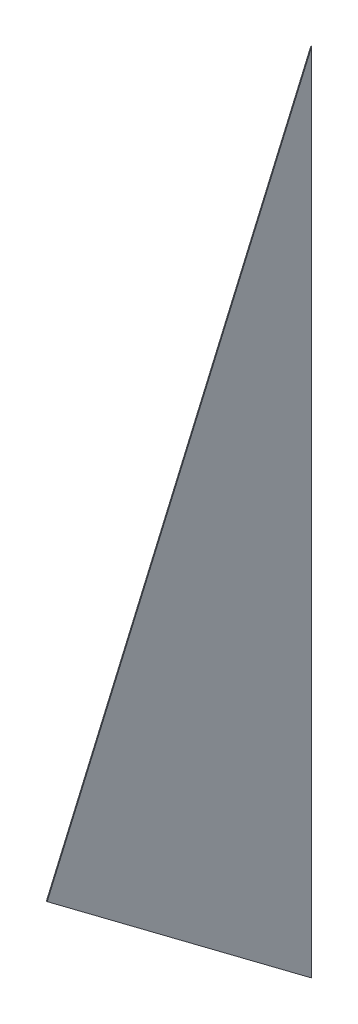
ISO-10303-21;
HEADER;
FILE_DESCRIPTION(('STEP AP214'),'2;1');
FILE_NAME('part.step','',(''),(''),'','','');
FILE_SCHEMA(('AUTOMOTIVE_DESIGN { 1 0 10303 214 1 1 1 1 }'));
ENDSEC;
DATA;
#1=APPLICATION_CONTEXT('core data for automotive mechanical design processes');
#2=APPLICATION_PROTOCOL_DEFINITION('international standard','automotive_design',2000,#1);
#3=PRODUCT_CONTEXT('',#1,'mechanical');
#4=PRODUCT('Part','Part','',(#3));
#5=PRODUCT_RELATED_PRODUCT_CATEGORY('part','',(#4));
#6=PRODUCT_DEFINITION_FORMATION('','',#4);
#7=PRODUCT_DEFINITION_CONTEXT('part definition',#1,'design');
#8=PRODUCT_DEFINITION('design','',#6,#7);
#9=PRODUCT_DEFINITION_SHAPE('','',#8);
#10=(LENGTH_UNIT() NAMED_UNIT(*) SI_UNIT(.MILLI.,.METRE.));
#11=(NAMED_UNIT(*) PLANE_ANGLE_UNIT() SI_UNIT($,.RADIAN.));
#12=(NAMED_UNIT(*) SI_UNIT($,.STERADIAN.) SOLID_ANGLE_UNIT());
#13=UNCERTAINTY_MEASURE_WITH_UNIT(LENGTH_MEASURE(1.E-05),#10,'distance_accuracy_value','');
#14=(GEOMETRIC_REPRESENTATION_CONTEXT(3) GLOBAL_UNCERTAINTY_ASSIGNED_CONTEXT((#13)) GLOBAL_UNIT_ASSIGNED_CONTEXT((#10,
#11,#12)) REPRESENTATION_CONTEXT('',''));
#15=CARTESIAN_POINT('',(0.,0.,0.));
#16=DIRECTION('',(0.,0.,1.));
#17=DIRECTION('',(1.,0.,0.));
#18=AXIS2_PLACEMENT_3D('',#15,#16,#17);
#19=CARTESIAN_POINT('',(1.5875,-762.,-1016.));
#20=DIRECTION('',(0.,0.8,-0.6));
#21=DIRECTION('',(0.,0.6,0.8));
#22=AXIS2_PLACEMENT_3D('',#19,#20,#21);
#23=PLANE('',#22);
#24=DIRECTION('',(0.,-0.6,-0.8));
#25=VECTOR('',#24,1.);
#26=CARTESIAN_POINT('',(-1.5875,-762.,-1016.));
#27=LINE('',#26,#25);
#28=CARTESIAN_POINT('',(-1.5875,0.,0.));
#29=VERTEX_POINT('',#28);
#30=CARTESIAN_POINT('',(-1.5875,-762.,-1016.));
#31=VERTEX_POINT('',#30);
#32=EDGE_CURVE('E79',#29,#31,#27,.T.);
#33=ORIENTED_EDGE('',*,*,#32,.T.);
#34=DIRECTION('',(-1.,0.,0.));
#35=VECTOR('',#34,1.);
#36=CARTESIAN_POINT('',(1.5875,-762.,-1016.));
#37=LINE('',#36,#35);
#38=CARTESIAN_POINT('',(1.5875,-762.,-1016.));
#39=VERTEX_POINT('',#38);
#40=EDGE_CURVE('E11',#39,#31,#37,.T.);
#41=ORIENTED_EDGE('',*,*,#40,.F.);
#42=DIRECTION('',(0.,-0.6,-0.8));
#43=VECTOR('',#42,1.);
#44=CARTESIAN_POINT('',(1.5875,-762.,-1016.));
#45=LINE('',#44,#43);
#46=CARTESIAN_POINT('',(1.5875,0.,0.));
#47=VERTEX_POINT('',#46);
#48=EDGE_CURVE('E72',#47,#39,#45,.T.);
#49=ORIENTED_EDGE('',*,*,#48,.F.);
#50=DIRECTION('',(-1.,0.,0.));
#51=VECTOR('',#50,1.);
#52=CARTESIAN_POINT('',(1.5875,0.,0.));
#53=LINE('',#52,#51);
#54=EDGE_CURVE('E80',#47,#29,#53,.T.);
#55=ORIENTED_EDGE('',*,*,#54,.T.);
#56=EDGE_LOOP('',(#33,#41,#49,#55));
#57=FACE_BOUND('',#56,.T.);
#58=ADVANCED_FACE('F32',(#57),#23,.F.);
#59=CARTESIAN_POINT('',(1.5875,2336.8,-1016.));
#60=DIRECTION('',(0.,0.,1.));
#61=DIRECTION('',(0.,-1.,0.));
#62=AXIS2_PLACEMENT_3D('',#59,#60,#61);
#63=PLANE('',#62);
#64=DIRECTION('',(0.,1.,0.));
#65=VECTOR('',#64,1.);
#66=CARTESIAN_POINT('',(-1.5875,2336.8,-1016.));
#67=LINE('',#66,#65);
#68=CARTESIAN_POINT('',(-1.5875,2336.8,-1016.));
#69=VERTEX_POINT('',#68);
#70=EDGE_CURVE('E60',#31,#69,#67,.T.);
#71=ORIENTED_EDGE('',*,*,#70,.T.);
#72=DIRECTION('',(-1.,0.,0.));
#73=VECTOR('',#72,1.);
#74=CARTESIAN_POINT('',(1.5875,2336.8,-1016.));
#75=LINE('',#74,#73);
#76=CARTESIAN_POINT('',(1.5875,2336.8,-1016.));
#77=VERTEX_POINT('',#76);
#78=EDGE_CURVE('E40',#77,#69,#75,.T.);
#79=ORIENTED_EDGE('',*,*,#78,.F.);
#80=DIRECTION('',(0.,1.,0.));
#81=VECTOR('',#80,1.);
#82=CARTESIAN_POINT('',(1.5875,2336.8,-1016.));
#83=LINE('',#82,#81);
#84=EDGE_CURVE('E68',#39,#77,#83,.T.);
#85=ORIENTED_EDGE('',*,*,#84,.F.);
#86=ORIENTED_EDGE('',*,*,#40,.T.);
#87=EDGE_LOOP('',(#71,#79,#85,#86));
#88=FACE_BOUND('',#87,.T.);
#89=ADVANCED_FACE('F69',(#88),#63,.F.);
#90=CARTESIAN_POINT('',(1.5875,0.,0.));
#91=DIRECTION('',(0.,-0.39872611141445,-0.917070056253235));
#92=DIRECTION('',(0.,0.917070056253235,-0.39872611141445));
#93=AXIS2_PLACEMENT_3D('',#90,#91,#92);
#94=PLANE('',#93);
#95=DIRECTION('',(0.,-0.917070056253235,0.39872611141445));
#96=VECTOR('',#95,1.);
#97=CARTESIAN_POINT('',(-1.5875,0.,0.));
#98=LINE('',#97,#96);
#99=EDGE_CURVE('E65',#69,#29,#98,.T.);
#100=ORIENTED_EDGE('',*,*,#99,.T.);
#101=ORIENTED_EDGE('',*,*,#54,.F.);
#102=DIRECTION('',(0.,-0.917070056253235,0.39872611141445));
#103=VECTOR('',#102,1.);
#104=CARTESIAN_POINT('',(1.5875,0.,0.));
#105=LINE('',#104,#103);
#106=EDGE_CURVE('E48',#77,#47,#105,.T.);
#107=ORIENTED_EDGE('',*,*,#106,.F.);
#108=ORIENTED_EDGE('',*,*,#78,.T.);
#109=EDGE_LOOP('',(#100,#101,#107,#108));
#110=FACE_BOUND('',#109,.T.);
#111=ADVANCED_FACE('F87',(#110),#94,.F.);
#112=CARTESIAN_POINT('',(1.5875,0.,0.));
#113=DIRECTION('',(-1.,0.,0.));
#114=DIRECTION('',(0.,0.,1.));
#115=AXIS2_PLACEMENT_3D('',#112,#113,#114);
#116=PLANE('',#115);
#117=ORIENTED_EDGE('',*,*,#48,.T.);
#118=ORIENTED_EDGE('',*,*,#84,.T.);
#119=ORIENTED_EDGE('',*,*,#106,.T.);
#120=EDGE_LOOP('',(#117,#118,#119));
#121=FACE_BOUND('',#120,.T.);
#122=ADVANCED_FACE('F75',(#121),#116,.F.);
#123=CARTESIAN_POINT('',(-1.5875,0.,0.));
#124=DIRECTION('',(-1.,0.,0.));
#125=DIRECTION('',(0.,0.,1.));
#126=AXIS2_PLACEMENT_3D('',#123,#124,#125);
#127=PLANE('',#126);
#128=ORIENTED_EDGE('',*,*,#32,.F.);
#129=ORIENTED_EDGE('',*,*,#99,.F.);
#130=ORIENTED_EDGE('',*,*,#70,.F.);
#131=EDGE_LOOP('',(#128,#129,#130));
#132=FACE_BOUND('',#131,.T.);
#133=ADVANCED_FACE('F88',(#132),#127,.T.);
#134=CLOSED_SHELL('',(#58,#89,#111,#122,#133));
#135=MANIFOLD_SOLID_BREP('B2',#134);
#136=ADVANCED_BREP_SHAPE_REPRESENTATION('',(#18,#135),#14);
#137=SHAPE_DEFINITION_REPRESENTATION(#9,#136);
ENDSEC;
END-ISO-10303-21;
